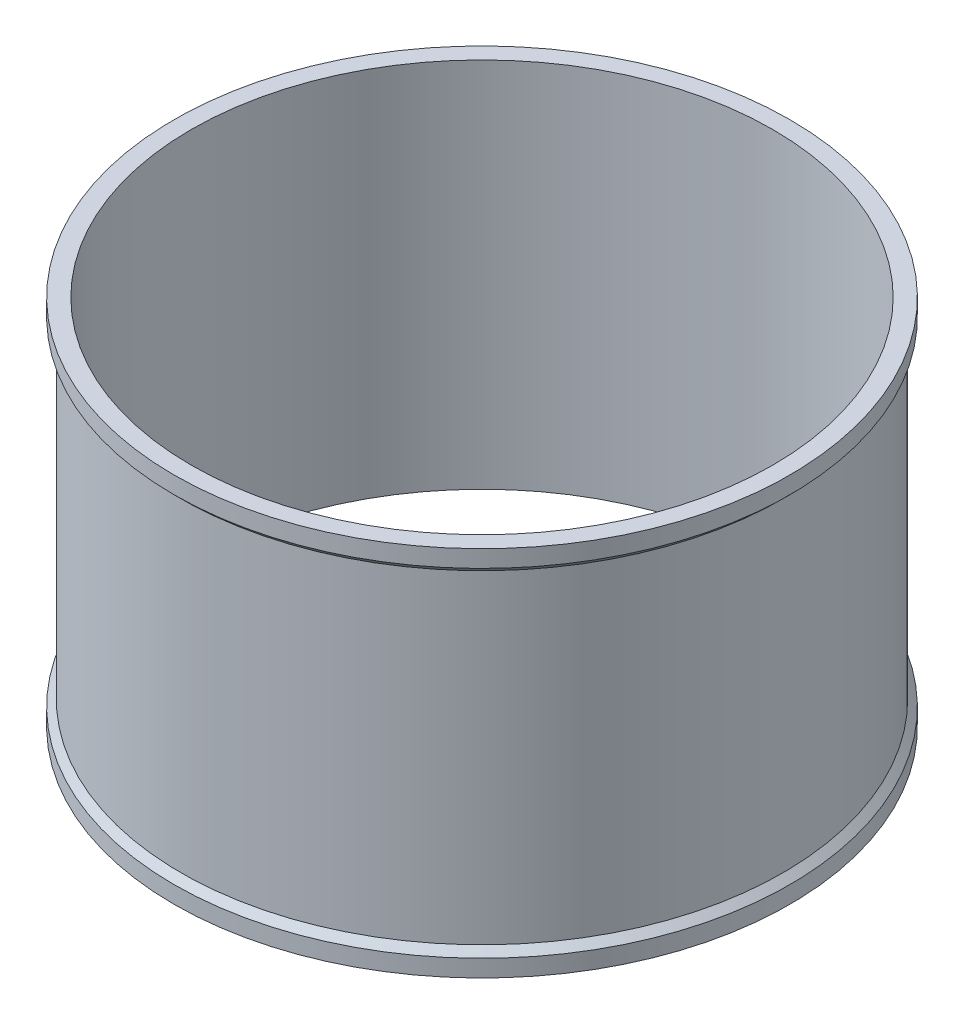
ISO-10303-21;
HEADER;
FILE_DESCRIPTION(('STEP AP214'),'2;1');
FILE_NAME('part.step','',(''),(''),'','','');
FILE_SCHEMA(('AUTOMOTIVE_DESIGN { 1 0 10303 214 1 1 1 1 }'));
ENDSEC;
DATA;
#1=APPLICATION_CONTEXT('core data for automotive mechanical design processes');
#2=APPLICATION_PROTOCOL_DEFINITION('international standard','automotive_design',2000,#1);
#3=PRODUCT_CONTEXT('',#1,'mechanical');
#4=PRODUCT('Part','Part','',(#3));
#5=PRODUCT_RELATED_PRODUCT_CATEGORY('part','',(#4));
#6=PRODUCT_DEFINITION_FORMATION('','',#4);
#7=PRODUCT_DEFINITION_CONTEXT('part definition',#1,'design');
#8=PRODUCT_DEFINITION('design','',#6,#7);
#9=PRODUCT_DEFINITION_SHAPE('','',#8);
#10=(LENGTH_UNIT() NAMED_UNIT(*) SI_UNIT(.MILLI.,.METRE.));
#11=(NAMED_UNIT(*) PLANE_ANGLE_UNIT() SI_UNIT($,.RADIAN.));
#12=(NAMED_UNIT(*) SI_UNIT($,.STERADIAN.) SOLID_ANGLE_UNIT());
#13=UNCERTAINTY_MEASURE_WITH_UNIT(LENGTH_MEASURE(1.E-05),#10,'distance_accuracy_value','');
#14=(GEOMETRIC_REPRESENTATION_CONTEXT(3) GLOBAL_UNCERTAINTY_ASSIGNED_CONTEXT((#13)) GLOBAL_UNIT_ASSIGNED_CONTEXT((#10,
#11,#12)) REPRESENTATION_CONTEXT('',''));
#15=CARTESIAN_POINT('',(0.,0.,0.));
#16=DIRECTION('',(0.,0.,1.));
#17=DIRECTION('',(1.,0.,0.));
#18=AXIS2_PLACEMENT_3D('',#15,#16,#17);
#19=CARTESIAN_POINT('',(0.,0.,0.));
#20=DIRECTION('',(0.,-1.,0.));
#21=DIRECTION('',(0.,0.,-1.));
#22=AXIS2_PLACEMENT_3D('',#19,#20,#21);
#23=CYLINDRICAL_SURFACE('',#22,85.);
#24=CARTESIAN_POINT('',(0.,0.,0.));
#25=DIRECTION('',(0.,-1.,0.));
#26=DIRECTION('',(0.,0.,-1.));
#27=AXIS2_PLACEMENT_3D('',#24,#25,#26);
#28=CIRCLE('',#27,85.);
#29=CARTESIAN_POINT('',(0.,0.,-85.));
#30=VERTEX_POINT('',#29);
#31=EDGE_CURVE('E10',#30,#30,#28,.T.);
#32=ORIENTED_EDGE('',*,*,#31,.T.);
#33=EDGE_LOOP('',(#32));
#34=FACE_BOUND('',#33,.T.);
#35=CARTESIAN_POINT('',(0.,108.7,0.));
#36=DIRECTION('',(0.,-1.,0.));
#37=DIRECTION('',(0.,0.,-1.));
#38=AXIS2_PLACEMENT_3D('',#35,#36,#37);
#39=CIRCLE('',#38,85.);
#40=CARTESIAN_POINT('',(0.,108.7,-85.));
#41=VERTEX_POINT('',#40);
#42=EDGE_CURVE('E59',#41,#41,#39,.T.);
#43=ORIENTED_EDGE('',*,*,#42,.F.);
#44=EDGE_LOOP('',(#43));
#45=FACE_BOUND('',#44,.T.);
#46=ADVANCED_FACE('F31',(#34,#45),#23,.F.);
#47=CARTESIAN_POINT('',(85.,0.,0.));
#48=DIRECTION('',(0.,-1.,0.));
#49=DIRECTION('',(0.,0.,-1.));
#50=AXIS2_PLACEMENT_3D('',#47,#48,#49);
#51=PLANE('',#50);
#52=CARTESIAN_POINT('',(0.,0.,0.));
#53=DIRECTION('',(0.,-1.,0.));
#54=DIRECTION('',(0.,0.,-1.));
#55=AXIS2_PLACEMENT_3D('',#52,#53,#54);
#56=CIRCLE('',#55,90.);
#57=CARTESIAN_POINT('',(0.,0.,-90.));
#58=VERTEX_POINT('',#57);
#59=EDGE_CURVE('E37',#58,#58,#56,.T.);
#60=ORIENTED_EDGE('',*,*,#59,.T.);
#61=EDGE_LOOP('',(#60));
#62=FACE_BOUND('',#61,.T.);
#63=ORIENTED_EDGE('',*,*,#31,.F.);
#64=EDGE_LOOP('',(#63));
#65=FACE_BOUND('',#64,.T.);
#66=ADVANCED_FACE('F67',(#62,#65),#51,.T.);
#67=CARTESIAN_POINT('',(0.,0.,0.));
#68=DIRECTION('',(0.,-1.,0.));
#69=DIRECTION('',(0.,0.,-1.));
#70=AXIS2_PLACEMENT_3D('',#67,#68,#69);
#71=CYLINDRICAL_SURFACE('',#70,90.);
#72=CARTESIAN_POINT('',(0.,5.,0.));
#73=DIRECTION('',(0.,-1.,0.));
#74=DIRECTION('',(0.,0.,-1.));
#75=AXIS2_PLACEMENT_3D('',#72,#73,#74);
#76=CIRCLE('',#75,90.);
#77=CARTESIAN_POINT('',(0.,5.,-90.));
#78=VERTEX_POINT('',#77);
#79=EDGE_CURVE('E41',#78,#78,#76,.T.);
#80=ORIENTED_EDGE('',*,*,#79,.T.);
#81=EDGE_LOOP('',(#80));
#82=FACE_BOUND('',#81,.T.);
#83=ORIENTED_EDGE('',*,*,#59,.F.);
#84=EDGE_LOOP('',(#83));
#85=FACE_BOUND('',#84,.T.);
#86=ADVANCED_FACE('F71',(#82,#85),#71,.T.);
#87=CARTESIAN_POINT('',(0.,5.,0.));
#88=DIRECTION('',(0.,-1.,0.));
#89=DIRECTION('',(0.,0.,-1.));
#90=AXIS2_PLACEMENT_3D('',#87,#88,#89);
#91=CONICAL_SURFACE('',#90,90.,0.78539816339745);
#92=CARTESIAN_POINT('',(0.,6.99999999999998,0.));
#93=DIRECTION('',(0.,-1.,0.));
#94=DIRECTION('',(0.,0.,-1.));
#95=AXIS2_PLACEMENT_3D('',#92,#93,#94);
#96=CIRCLE('',#95,88.);
#97=CARTESIAN_POINT('',(0.,6.99999999999998,-88.));
#98=VERTEX_POINT('',#97);
#99=EDGE_CURVE('E45',#98,#98,#96,.T.);
#100=ORIENTED_EDGE('',*,*,#99,.T.);
#101=EDGE_LOOP('',(#100));
#102=FACE_BOUND('',#101,.T.);
#103=ORIENTED_EDGE('',*,*,#79,.F.);
#104=EDGE_LOOP('',(#103));
#105=FACE_BOUND('',#104,.T.);
#106=ADVANCED_FACE('F75',(#102,#105),#91,.T.);
#107=CARTESIAN_POINT('',(0.,0.,0.));
#108=DIRECTION('',(0.,-1.,0.));
#109=DIRECTION('',(0.,0.,-1.));
#110=AXIS2_PLACEMENT_3D('',#107,#108,#109);
#111=CYLINDRICAL_SURFACE('',#110,88.);
#112=CARTESIAN_POINT('',(0.,101.7,0.));
#113=DIRECTION('',(0.,-1.,0.));
#114=DIRECTION('',(0.,0.,-1.));
#115=AXIS2_PLACEMENT_3D('',#112,#113,#114);
#116=CIRCLE('',#115,88.);
#117=CARTESIAN_POINT('',(0.,101.7,-88.));
#118=VERTEX_POINT('',#117);
#119=EDGE_CURVE('E50',#118,#118,#116,.T.);
#120=ORIENTED_EDGE('',*,*,#119,.T.);
#121=EDGE_LOOP('',(#120));
#122=FACE_BOUND('',#121,.T.);
#123=ORIENTED_EDGE('',*,*,#99,.F.);
#124=EDGE_LOOP('',(#123));
#125=FACE_BOUND('',#124,.T.);
#126=ADVANCED_FACE('F82',(#122,#125),#111,.T.);
#127=CARTESIAN_POINT('',(0.,101.7,0.));
#128=DIRECTION('',(0.,1.,0.));
#129=DIRECTION('',(0.,0.,1.));
#130=AXIS2_PLACEMENT_3D('',#127,#128,#129);
#131=CONICAL_SURFACE('',#130,88.,0.785398163397445);
#132=CARTESIAN_POINT('',(0.,103.7,0.));
#133=DIRECTION('',(0.,-1.,0.));
#134=DIRECTION('',(0.,0.,-1.));
#135=AXIS2_PLACEMENT_3D('',#132,#133,#134);
#136=CIRCLE('',#135,90.);
#137=CARTESIAN_POINT('',(0.,103.7,-90.));
#138=VERTEX_POINT('',#137);
#139=EDGE_CURVE('E53',#138,#138,#136,.T.);
#140=ORIENTED_EDGE('',*,*,#139,.T.);
#141=EDGE_LOOP('',(#140));
#142=FACE_BOUND('',#141,.T.);
#143=ORIENTED_EDGE('',*,*,#119,.F.);
#144=EDGE_LOOP('',(#143));
#145=FACE_BOUND('',#144,.T.);
#146=ADVANCED_FACE('F86',(#142,#145),#131,.T.);
#147=CARTESIAN_POINT('',(0.,0.,0.));
#148=DIRECTION('',(0.,-1.,0.));
#149=DIRECTION('',(0.,0.,-1.));
#150=AXIS2_PLACEMENT_3D('',#147,#148,#149);
#151=CYLINDRICAL_SURFACE('',#150,90.);
#152=CARTESIAN_POINT('',(0.,108.7,0.));
#153=DIRECTION('',(0.,-1.,0.));
#154=DIRECTION('',(0.,0.,-1.));
#155=AXIS2_PLACEMENT_3D('',#152,#153,#154);
#156=CIRCLE('',#155,90.);
#157=CARTESIAN_POINT('',(0.,108.7,-90.));
#158=VERTEX_POINT('',#157);
#159=EDGE_CURVE('E56',#158,#158,#156,.T.);
#160=ORIENTED_EDGE('',*,*,#159,.T.);
#161=EDGE_LOOP('',(#160));
#162=FACE_BOUND('',#161,.T.);
#163=ORIENTED_EDGE('',*,*,#139,.F.);
#164=EDGE_LOOP('',(#163));
#165=FACE_BOUND('',#164,.T.);
#166=ADVANCED_FACE('F90',(#162,#165),#151,.T.);
#167=CARTESIAN_POINT('',(90.,108.7,0.));
#168=DIRECTION('',(0.,1.,0.));
#169=DIRECTION('',(0.,0.,1.));
#170=AXIS2_PLACEMENT_3D('',#167,#168,#169);
#171=PLANE('',#170);
#172=ORIENTED_EDGE('',*,*,#42,.T.);
#173=EDGE_LOOP('',(#172));
#174=FACE_BOUND('',#173,.T.);
#175=ORIENTED_EDGE('',*,*,#159,.F.);
#176=EDGE_LOOP('',(#175));
#177=FACE_BOUND('',#176,.T.);
#178=ADVANCED_FACE('F63',(#174,#177),#171,.T.);
#179=CLOSED_SHELL('',(#46,#66,#86,#106,#126,#146,#166,#178));
#180=MANIFOLD_SOLID_BREP('B2',#179);
#181=ADVANCED_BREP_SHAPE_REPRESENTATION('',(#18,#180),#14);
#182=SHAPE_DEFINITION_REPRESENTATION(#9,#181);
ENDSEC;
END-ISO-10303-21;
